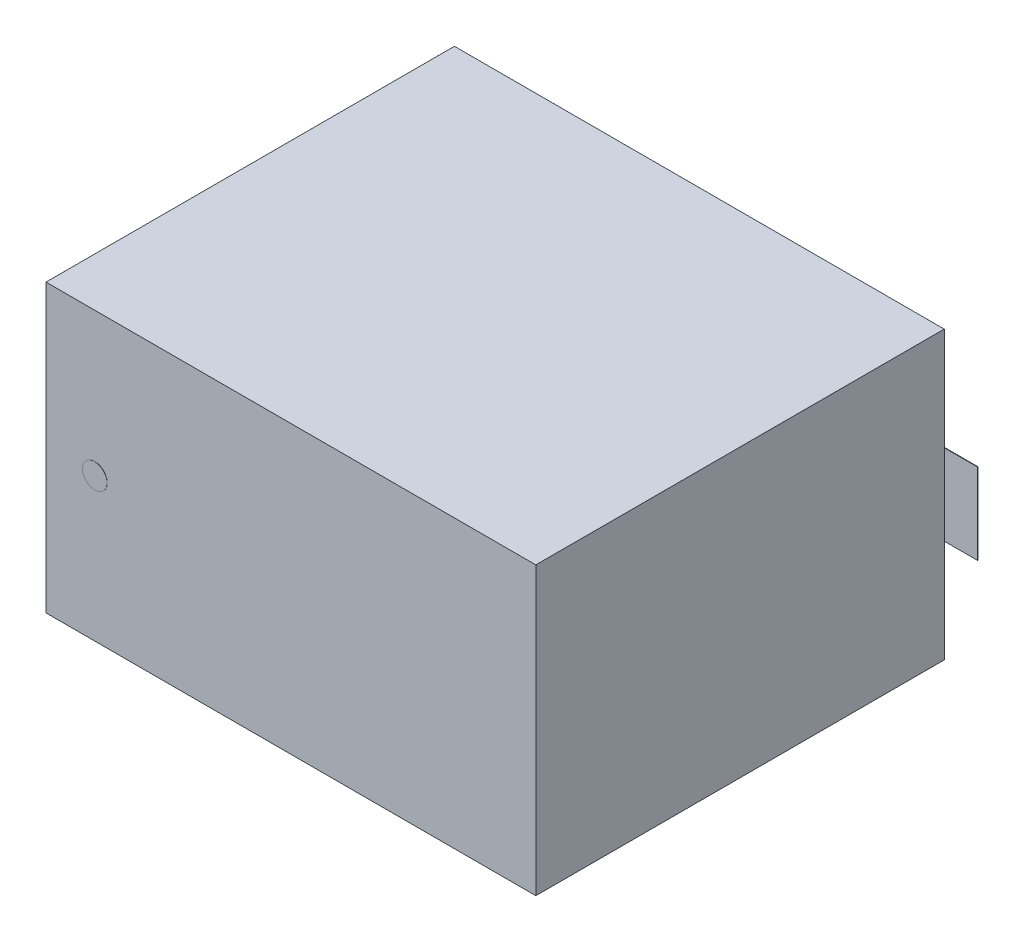
ISO-10303-21;
HEADER;
FILE_DESCRIPTION(('STEP AP214'),'2;1');
FILE_NAME('part.step','',(''),(''),'','','');
FILE_SCHEMA(('AUTOMOTIVE_DESIGN { 1 0 10303 214 1 1 1 1 }'));
ENDSEC;
DATA;
#1=APPLICATION_CONTEXT('core data for automotive mechanical design processes');
#2=APPLICATION_PROTOCOL_DEFINITION('international standard','automotive_design',2000,#1);
#3=PRODUCT_CONTEXT('',#1,'mechanical');
#4=PRODUCT('Part','Part','',(#3));
#5=PRODUCT_RELATED_PRODUCT_CATEGORY('part','',(#4));
#6=PRODUCT_DEFINITION_FORMATION('','',#4);
#7=PRODUCT_DEFINITION_CONTEXT('part definition',#1,'design');
#8=PRODUCT_DEFINITION('design','',#6,#7);
#9=PRODUCT_DEFINITION_SHAPE('','',#8);
#10=(LENGTH_UNIT() NAMED_UNIT(*) SI_UNIT(.MILLI.,.METRE.));
#11=(NAMED_UNIT(*) PLANE_ANGLE_UNIT() SI_UNIT($,.RADIAN.));
#12=(NAMED_UNIT(*) SI_UNIT($,.STERADIAN.) SOLID_ANGLE_UNIT());
#13=UNCERTAINTY_MEASURE_WITH_UNIT(LENGTH_MEASURE(1.E-05),#10,'distance_accuracy_value','');
#14=(GEOMETRIC_REPRESENTATION_CONTEXT(3) GLOBAL_UNCERTAINTY_ASSIGNED_CONTEXT((#13)) GLOBAL_UNIT_ASSIGNED_CONTEXT((#10,
#11,#12)) REPRESENTATION_CONTEXT('',''));
#15=CARTESIAN_POINT('',(0.,0.,0.));
#16=DIRECTION('',(0.,0.,1.));
#17=DIRECTION('',(1.,0.,0.));
#18=AXIS2_PLACEMENT_3D('',#15,#16,#17);
#19=CARTESIAN_POINT('',(-2.398,0.,5.004));
#20=DIRECTION('',(0.,0.,1.));
#21=DIRECTION('',(1.,0.,0.));
#22=AXIS2_PLACEMENT_3D('',#19,#20,#21);
#23=CYLINDRICAL_SURFACE('',#22,0.14986);
#24=CARTESIAN_POINT('',(-2.398,0.,5.006));
#25=DIRECTION('',(0.,0.,1.));
#26=DIRECTION('',(1.,0.,0.));
#27=AXIS2_PLACEMENT_3D('',#24,#25,#26);
#28=CIRCLE('',#27,0.14986);
#29=CARTESIAN_POINT('',(-2.548,0.,5.006));
#30=VERTEX_POINT('',#29);
#31=EDGE_CURVE('P0_E11',#30,#30,#28,.T.);
#32=ORIENTED_EDGE('',*,*,#31,.F.);
#33=CARTESIAN_POINT('',(-2.54786,0.,5.004));
#34=CARTESIAN_POINT('',(-2.54786,0.,5.006));
#35=B_SPLINE_CURVE_WITH_KNOTS('',1,(#33,#34),.UNSPECIFIED.,.F.,.F.,(2,2),(0.,
0.0020000000000007),.UNSPECIFIED.);
#36=CARTESIAN_POINT('',(-2.548,0.,5.004));
#37=VERTEX_POINT('',#36);
#38=EDGE_CURVE('P0_E24',#37,#30,#35,.T.);
#39=ORIENTED_EDGE('',*,*,#38,.F.);
#40=CARTESIAN_POINT('',(-2.398,0.,5.004));
#41=DIRECTION('',(0.,0.,-1.));
#42=DIRECTION('',(1.,0.,0.));
#43=AXIS2_PLACEMENT_3D('',#40,#41,#42);
#44=CIRCLE('',#43,0.14986);
#45=EDGE_CURVE('P0_E33',#37,#37,#44,.T.);
#46=ORIENTED_EDGE('',*,*,#45,.F.);
#47=ORIENTED_EDGE('',*,*,#38,.T.);
#48=EDGE_LOOP('',(#32,#39,#46,#47));
#49=FACE_BOUND('',#48,.T.);
#50=ADVANCED_FACE('P0_F17',(#49),#23,.T.);
#51=CARTESIAN_POINT('',(-2.398,0.,5.004));
#52=DIRECTION('',(0.,0.,1.));
#53=DIRECTION('',(0.,1.,0.));
#54=AXIS2_PLACEMENT_3D('',#51,#52,#53);
#55=PLANE('',#54);
#56=ORIENTED_EDGE('',*,*,#45,.T.);
#57=EDGE_LOOP('',(#56));
#58=FACE_BOUND('',#57,.T.);
#59=ADVANCED_FACE('P0_F36',(#58),#55,.F.);
#60=CARTESIAN_POINT('',(-2.398,0.,5.006));
#61=DIRECTION('',(0.,0.,1.));
#62=DIRECTION('',(0.,1.,0.));
#63=AXIS2_PLACEMENT_3D('',#60,#61,#62);
#64=PLANE('',#63);
#65=ORIENTED_EDGE('',*,*,#31,.T.);
#66=EDGE_LOOP('',(#65));
#67=FACE_BOUND('',#66,.T.);
#68=ADVANCED_FACE('P0_F49',(#67),#64,.T.);
#69=CLOSED_SHELL('',(#50,#59,#68));
#70=MANIFOLD_SOLID_BREP('P0_B1',#69);
#71=CARTESIAN_POINT('',(-2.997,-1.753,0.006));
#72=DIRECTION('',(0.,-1.,0.));
#73=DIRECTION('',(0.,0.,1.));
#74=AXIS2_PLACEMENT_3D('',#71,#72,#73);
#75=PLANE('',#74);
#76=DIRECTION('',(-1.,0.,0.));
#77=VECTOR('',#76,1.);
#78=CARTESIAN_POINT('',(2.997,-1.753,0.006));
#79=LINE('',#78,#77);
#80=CARTESIAN_POINT('',(2.997,-1.753,0.006));
#81=VERTEX_POINT('',#80);
#82=CARTESIAN_POINT('',(-2.997,-1.753,0.006));
#83=VERTEX_POINT('',#82);
#84=EDGE_CURVE('P1_E11',#81,#83,#79,.T.);
#85=ORIENTED_EDGE('',*,*,#84,.F.);
#86=DIRECTION('',(0.,0.,-1.));
#87=VECTOR('',#86,1.);
#88=CARTESIAN_POINT('',(2.997,-1.753,5.004));
#89=LINE('',#88,#87);
#90=CARTESIAN_POINT('',(2.997,-1.753,5.004));
#91=VERTEX_POINT('',#90);
#92=EDGE_CURVE('P1_E24',#91,#81,#89,.T.);
#93=ORIENTED_EDGE('',*,*,#92,.F.);
#94=DIRECTION('',(1.,0.,0.));
#95=VECTOR('',#94,1.);
#96=CARTESIAN_POINT('',(-2.997,-1.753,5.004));
#97=LINE('',#96,#95);
#98=CARTESIAN_POINT('',(-2.997,-1.753,5.004));
#99=VERTEX_POINT('',#98);
#100=EDGE_CURVE('P1_E88',#99,#91,#97,.T.);
#101=ORIENTED_EDGE('',*,*,#100,.F.);
#102=DIRECTION('',(0.,0.,1.));
#103=VECTOR('',#102,1.);
#104=CARTESIAN_POINT('',(-2.997,-1.753,0.006));
#105=LINE('',#104,#103);
#106=EDGE_CURVE('P1_E77',#83,#99,#105,.T.);
#107=ORIENTED_EDGE('',*,*,#106,.F.);
#108=EDGE_LOOP('',(#85,#93,#101,#107));
#109=FACE_BOUND('',#108,.T.);
#110=ADVANCED_FACE('P1_F17',(#109),#75,.T.);
#111=CARTESIAN_POINT('',(2.997,-1.753,0.006));
#112=DIRECTION('',(1.,0.,0.));
#113=DIRECTION('',(0.,0.,1.));
#114=AXIS2_PLACEMENT_3D('',#111,#112,#113);
#115=PLANE('',#114);
#116=DIRECTION('',(0.,-1.,0.));
#117=VECTOR('',#116,1.);
#118=CARTESIAN_POINT('',(2.997,1.753,0.006));
#119=LINE('',#118,#117);
#120=CARTESIAN_POINT('',(2.997,1.753,0.006));
#121=VERTEX_POINT('',#120);
#122=EDGE_CURVE('P1_E85',#121,#81,#119,.T.);
#123=ORIENTED_EDGE('',*,*,#122,.F.);
#124=DIRECTION('',(0.,0.,-1.));
#125=VECTOR('',#124,1.);
#126=CARTESIAN_POINT('',(2.997,1.753,5.004));
#127=LINE('',#126,#125);
#128=CARTESIAN_POINT('',(2.997,1.753,5.004));
#129=VERTEX_POINT('',#128);
#130=EDGE_CURVE('P1_E83',#129,#121,#127,.T.);
#131=ORIENTED_EDGE('',*,*,#130,.F.);
#132=DIRECTION('',(0.,1.,0.));
#133=VECTOR('',#132,1.);
#134=CARTESIAN_POINT('',(2.997,-1.753,5.004));
#135=LINE('',#134,#133);
#136=EDGE_CURVE('P1_E72',#91,#129,#135,.T.);
#137=ORIENTED_EDGE('',*,*,#136,.F.);
#138=ORIENTED_EDGE('',*,*,#92,.T.);
#139=EDGE_LOOP('',(#123,#131,#137,#138));
#140=FACE_BOUND('',#139,.T.);
#141=ADVANCED_FACE('P1_F90',(#140),#115,.T.);
#142=CARTESIAN_POINT('',(2.997,1.753,0.006));
#143=DIRECTION('',(0.,1.,0.));
#144=DIRECTION('',(0.,0.,1.));
#145=AXIS2_PLACEMENT_3D('',#142,#143,#144);
#146=PLANE('',#145);
#147=DIRECTION('',(1.,0.,0.));
#148=VECTOR('',#147,1.);
#149=CARTESIAN_POINT('',(-2.997,1.753,0.006));
#150=LINE('',#149,#148);
#151=CARTESIAN_POINT('',(-2.997,1.753,0.006));
#152=VERTEX_POINT('',#151);
#153=EDGE_CURVE('P1_E60',#152,#121,#150,.T.);
#154=ORIENTED_EDGE('',*,*,#153,.F.);
#155=DIRECTION('',(0.,0.,-1.));
#156=VECTOR('',#155,1.);
#157=CARTESIAN_POINT('',(-2.997,1.753,5.004));
#158=LINE('',#157,#156);
#159=CARTESIAN_POINT('',(-2.997,1.753,5.004));
#160=VERTEX_POINT('',#159);
#161=EDGE_CURVE('P1_E54',#160,#152,#158,.T.);
#162=ORIENTED_EDGE('',*,*,#161,.F.);
#163=DIRECTION('',(-1.,0.,0.));
#164=VECTOR('',#163,1.);
#165=CARTESIAN_POINT('',(2.997,1.753,5.004));
#166=LINE('',#165,#164);
#167=EDGE_CURVE('P1_E58',#129,#160,#166,.T.);
#168=ORIENTED_EDGE('',*,*,#167,.F.);
#169=ORIENTED_EDGE('',*,*,#130,.T.);
#170=EDGE_LOOP('',(#154,#162,#168,#169));
#171=FACE_BOUND('',#170,.T.);
#172=ADVANCED_FACE('P1_F56',(#171),#146,.T.);
#173=CARTESIAN_POINT('',(-2.997,1.753,0.006));
#174=DIRECTION('',(-1.,0.,0.));
#175=DIRECTION('',(0.,0.,1.));
#176=AXIS2_PLACEMENT_3D('',#173,#174,#175);
#177=PLANE('',#176);
#178=DIRECTION('',(0.,1.,0.));
#179=VECTOR('',#178,1.);
#180=CARTESIAN_POINT('',(-2.997,-1.753,0.006));
#181=LINE('',#180,#179);
#182=EDGE_CURVE('P1_E73',#83,#152,#181,.T.);
#183=ORIENTED_EDGE('',*,*,#182,.F.);
#184=ORIENTED_EDGE('',*,*,#106,.T.);
#185=DIRECTION('',(0.,-1.,0.));
#186=VECTOR('',#185,1.);
#187=CARTESIAN_POINT('',(-2.997,1.753,5.004));
#188=LINE('',#187,#186);
#189=EDGE_CURVE('P1_E70',#160,#99,#188,.T.);
#190=ORIENTED_EDGE('',*,*,#189,.F.);
#191=ORIENTED_EDGE('',*,*,#161,.T.);
#192=EDGE_LOOP('',(#183,#184,#190,#191));
#193=FACE_BOUND('',#192,.T.);
#194=ADVANCED_FACE('P1_F76',(#193),#177,.T.);
#195=CARTESIAN_POINT('',(-2.997,1.753,0.006));
#196=DIRECTION('',(0.,0.,-1.));
#197=DIRECTION('',(0.,1.,0.));
#198=AXIS2_PLACEMENT_3D('',#195,#196,#197);
#199=PLANE('',#198);
#200=ORIENTED_EDGE('',*,*,#153,.T.);
#201=ORIENTED_EDGE('',*,*,#122,.T.);
#202=ORIENTED_EDGE('',*,*,#84,.T.);
#203=ORIENTED_EDGE('',*,*,#182,.T.);
#204=EDGE_LOOP('',(#200,#201,#202,#203));
#205=FACE_BOUND('',#204,.T.);
#206=ADVANCED_FACE('P1_F91',(#205),#199,.T.);
#207=CARTESIAN_POINT('',(-2.997,-1.753,5.004));
#208=DIRECTION('',(0.,0.,1.));
#209=DIRECTION('',(0.,1.,0.));
#210=AXIS2_PLACEMENT_3D('',#207,#208,#209);
#211=PLANE('',#210);
#212=ORIENTED_EDGE('',*,*,#100,.T.);
#213=ORIENTED_EDGE('',*,*,#136,.T.);
#214=ORIENTED_EDGE('',*,*,#167,.T.);
#215=ORIENTED_EDGE('',*,*,#189,.T.);
#216=EDGE_LOOP('',(#212,#213,#214,#215));
#217=FACE_BOUND('',#216,.T.);
#218=ADVANCED_FACE('P1_F69',(#217),#211,.T.);
#219=CLOSED_SHELL('',(#110,#141,#172,#194,#206,#218));
#220=MANIFOLD_SOLID_BREP('P1_B1',#219);
#221=CARTESIAN_POINT('',(1.295,-0.495,0.));
#222=DIRECTION('',(0.,-1.,0.));
#223=DIRECTION('',(0.,0.,1.));
#224=AXIS2_PLACEMENT_3D('',#221,#222,#223);
#225=PLANE('',#224);
#226=DIRECTION('',(-1.,0.,0.));
#227=VECTOR('',#226,1.);
#228=CARTESIAN_POINT('',(3.404,-0.495000000000001,0.));
#229=LINE('',#228,#227);
#230=CARTESIAN_POINT('',(3.404,-0.495000000000001,0.));
#231=VERTEX_POINT('',#230);
#232=CARTESIAN_POINT('',(1.295,-0.495,0.));
#233=VERTEX_POINT('',#232);
#234=EDGE_CURVE('P2_E11',#231,#233,#229,.T.);
#235=ORIENTED_EDGE('',*,*,#234,.F.);
#236=DIRECTION('',(0.,0.,-1.));
#237=VECTOR('',#236,1.);
#238=CARTESIAN_POINT('',(3.404,-0.495000000000001,0.006));
#239=LINE('',#238,#237);
#240=CARTESIAN_POINT('',(3.404,-0.495000000000001,0.006));
#241=VERTEX_POINT('',#240);
#242=EDGE_CURVE('P2_E24',#241,#231,#239,.T.);
#243=ORIENTED_EDGE('',*,*,#242,.F.);
#244=DIRECTION('',(1.,0.,0.));
#245=VECTOR('',#244,1.);
#246=CARTESIAN_POINT('',(1.295,-0.495,0.006));
#247=LINE('',#246,#245);
#248=CARTESIAN_POINT('',(1.295,-0.495,0.006));
#249=VERTEX_POINT('',#248);
#250=EDGE_CURVE('P2_E88',#249,#241,#247,.T.);
#251=ORIENTED_EDGE('',*,*,#250,.F.);
#252=DIRECTION('',(0.,0.,1.));
#253=VECTOR('',#252,1.);
#254=CARTESIAN_POINT('',(1.295,-0.495,0.));
#255=LINE('',#254,#253);
#256=EDGE_CURVE('P2_E77',#233,#249,#255,.T.);
#257=ORIENTED_EDGE('',*,*,#256,.F.);
#258=EDGE_LOOP('',(#235,#243,#251,#257));
#259=FACE_BOUND('',#258,.T.);
#260=ADVANCED_FACE('P2_F17',(#259),#225,.T.);
#261=CARTESIAN_POINT('',(3.404,-0.495000000000001,0.));
#262=DIRECTION('',(1.,0.,0.));
#263=DIRECTION('',(0.,0.,1.));
#264=AXIS2_PLACEMENT_3D('',#261,#262,#263);
#265=PLANE('',#264);
#266=DIRECTION('',(0.,-1.,0.));
#267=VECTOR('',#266,1.);
#268=CARTESIAN_POINT('',(3.404,0.494999999999999,0.));
#269=LINE('',#268,#267);
#270=CARTESIAN_POINT('',(3.404,0.494999999999999,0.));
#271=VERTEX_POINT('',#270);
#272=EDGE_CURVE('P2_E85',#271,#231,#269,.T.);
#273=ORIENTED_EDGE('',*,*,#272,.F.);
#274=DIRECTION('',(0.,0.,-1.));
#275=VECTOR('',#274,1.);
#276=CARTESIAN_POINT('',(3.404,0.494999999999999,0.006));
#277=LINE('',#276,#275);
#278=CARTESIAN_POINT('',(3.404,0.494999999999999,0.006));
#279=VERTEX_POINT('',#278);
#280=EDGE_CURVE('P2_E83',#279,#271,#277,.T.);
#281=ORIENTED_EDGE('',*,*,#280,.F.);
#282=DIRECTION('',(0.,1.,0.));
#283=VECTOR('',#282,1.);
#284=CARTESIAN_POINT('',(3.404,-0.495000000000001,0.006));
#285=LINE('',#284,#283);
#286=EDGE_CURVE('P2_E72',#241,#279,#285,.T.);
#287=ORIENTED_EDGE('',*,*,#286,.F.);
#288=ORIENTED_EDGE('',*,*,#242,.T.);
#289=EDGE_LOOP('',(#273,#281,#287,#288));
#290=FACE_BOUND('',#289,.T.);
#291=ADVANCED_FACE('P2_F90',(#290),#265,.T.);
#292=CARTESIAN_POINT('',(3.404,0.494999999999999,0.));
#293=DIRECTION('',(0.,1.,0.));
#294=DIRECTION('',(0.,0.,1.));
#295=AXIS2_PLACEMENT_3D('',#292,#293,#294);
#296=PLANE('',#295);
#297=DIRECTION('',(1.,0.,0.));
#298=VECTOR('',#297,1.);
#299=CARTESIAN_POINT('',(1.295,0.495,0.));
#300=LINE('',#299,#298);
#301=CARTESIAN_POINT('',(1.295,0.495,0.));
#302=VERTEX_POINT('',#301);
#303=EDGE_CURVE('P2_E60',#302,#271,#300,.T.);
#304=ORIENTED_EDGE('',*,*,#303,.F.);
#305=DIRECTION('',(0.,0.,-1.));
#306=VECTOR('',#305,1.);
#307=CARTESIAN_POINT('',(1.295,0.495,0.006));
#308=LINE('',#307,#306);
#309=CARTESIAN_POINT('',(1.295,0.495,0.006));
#310=VERTEX_POINT('',#309);
#311=EDGE_CURVE('P2_E54',#310,#302,#308,.T.);
#312=ORIENTED_EDGE('',*,*,#311,.F.);
#313=DIRECTION('',(-1.,0.,0.));
#314=VECTOR('',#313,1.);
#315=CARTESIAN_POINT('',(3.404,0.494999999999999,0.006));
#316=LINE('',#315,#314);
#317=EDGE_CURVE('P2_E58',#279,#310,#316,.T.);
#318=ORIENTED_EDGE('',*,*,#317,.F.);
#319=ORIENTED_EDGE('',*,*,#280,.T.);
#320=EDGE_LOOP('',(#304,#312,#318,#319));
#321=FACE_BOUND('',#320,.T.);
#322=ADVANCED_FACE('P2_F56',(#321),#296,.T.);
#323=CARTESIAN_POINT('',(1.295,0.495,0.));
#324=DIRECTION('',(-1.,0.,0.));
#325=DIRECTION('',(0.,0.,1.));
#326=AXIS2_PLACEMENT_3D('',#323,#324,#325);
#327=PLANE('',#326);
#328=DIRECTION('',(0.,1.,0.));
#329=VECTOR('',#328,1.);
#330=CARTESIAN_POINT('',(1.295,-0.495,0.));
#331=LINE('',#330,#329);
#332=EDGE_CURVE('P2_E73',#233,#302,#331,.T.);
#333=ORIENTED_EDGE('',*,*,#332,.F.);
#334=ORIENTED_EDGE('',*,*,#256,.T.);
#335=DIRECTION('',(0.,-1.,0.));
#336=VECTOR('',#335,1.);
#337=CARTESIAN_POINT('',(1.295,0.495,0.006));
#338=LINE('',#337,#336);
#339=EDGE_CURVE('P2_E70',#310,#249,#338,.T.);
#340=ORIENTED_EDGE('',*,*,#339,.F.);
#341=ORIENTED_EDGE('',*,*,#311,.T.);
#342=EDGE_LOOP('',(#333,#334,#340,#341));
#343=FACE_BOUND('',#342,.T.);
#344=ADVANCED_FACE('P2_F76',(#343),#327,.T.);
#345=CARTESIAN_POINT('',(1.295,0.495,0.));
#346=DIRECTION('',(0.,0.,-1.));
#347=DIRECTION('',(0.,1.,0.));
#348=AXIS2_PLACEMENT_3D('',#345,#346,#347);
#349=PLANE('',#348);
#350=ORIENTED_EDGE('',*,*,#303,.T.);
#351=ORIENTED_EDGE('',*,*,#272,.T.);
#352=ORIENTED_EDGE('',*,*,#234,.T.);
#353=ORIENTED_EDGE('',*,*,#332,.T.);
#354=EDGE_LOOP('',(#350,#351,#352,#353));
#355=FACE_BOUND('',#354,.T.);
#356=ADVANCED_FACE('P2_F91',(#355),#349,.T.);
#357=CARTESIAN_POINT('',(1.295,-0.495,0.006));
#358=DIRECTION('',(0.,0.,1.));
#359=DIRECTION('',(0.,1.,0.));
#360=AXIS2_PLACEMENT_3D('',#357,#358,#359);
#361=PLANE('',#360);
#362=ORIENTED_EDGE('',*,*,#250,.T.);
#363=ORIENTED_EDGE('',*,*,#286,.T.);
#364=ORIENTED_EDGE('',*,*,#317,.T.);
#365=ORIENTED_EDGE('',*,*,#339,.T.);
#366=EDGE_LOOP('',(#362,#363,#364,#365));
#367=FACE_BOUND('',#366,.T.);
#368=ADVANCED_FACE('P2_F69',(#367),#361,.T.);
#369=CLOSED_SHELL('',(#260,#291,#322,#344,#356,#368));
#370=MANIFOLD_SOLID_BREP('P2_B1',#369);
#371=CARTESIAN_POINT('',(-3.404,-0.494999999999999,0.));
#372=DIRECTION('',(0.,-1.,0.));
#373=DIRECTION('',(0.,0.,1.));
#374=AXIS2_PLACEMENT_3D('',#371,#372,#373);
#375=PLANE('',#374);
#376=DIRECTION('',(-1.,0.,0.));
#377=VECTOR('',#376,1.);
#378=CARTESIAN_POINT('',(-1.295,-0.495,0.));
#379=LINE('',#378,#377);
#380=CARTESIAN_POINT('',(-1.295,-0.495,0.));
#381=VERTEX_POINT('',#380);
#382=CARTESIAN_POINT('',(-3.404,-0.494999999999999,0.));
#383=VERTEX_POINT('',#382);
#384=EDGE_CURVE('P3_E10',#381,#383,#379,.T.);
#385=ORIENTED_EDGE('',*,*,#384,.F.);
#386=DIRECTION('',(0.,0.,-1.));
#387=VECTOR('',#386,1.);
#388=CARTESIAN_POINT('',(-1.295,-0.495,0.006));
#389=LINE('',#388,#387);
#390=CARTESIAN_POINT('',(-1.295,-0.495,0.006));
#391=VERTEX_POINT('',#390);
#392=EDGE_CURVE('P3_E23',#391,#381,#389,.T.);
#393=ORIENTED_EDGE('',*,*,#392,.F.);
#394=DIRECTION('',(1.,0.,0.));
#395=VECTOR('',#394,1.);
#396=CARTESIAN_POINT('',(-3.404,-0.494999999999999,0.006));
#397=LINE('',#396,#395);
#398=CARTESIAN_POINT('',(-3.404,-0.494999999999999,0.006));
#399=VERTEX_POINT('',#398);
#400=EDGE_CURVE('P3_E86',#399,#391,#397,.T.);
#401=ORIENTED_EDGE('',*,*,#400,.F.);
#402=DIRECTION('',(0.,0.,1.));
#403=VECTOR('',#402,1.);
#404=CARTESIAN_POINT('',(-3.404,-0.494999999999999,0.));
#405=LINE('',#404,#403);
#406=EDGE_CURVE('P3_E75',#383,#399,#405,.T.);
#407=ORIENTED_EDGE('',*,*,#406,.F.);
#408=EDGE_LOOP('',(#385,#393,#401,#407));
#409=FACE_BOUND('',#408,.T.);
#410=ADVANCED_FACE('P3_F16',(#409),#375,.T.);
#411=CARTESIAN_POINT('',(-1.295,-0.495,0.));
#412=DIRECTION('',(1.,0.,0.));
#413=DIRECTION('',(0.,0.,1.));
#414=AXIS2_PLACEMENT_3D('',#411,#412,#413);
#415=PLANE('',#414);
#416=DIRECTION('',(0.,-1.,0.));
#417=VECTOR('',#416,1.);
#418=CARTESIAN_POINT('',(-1.295,0.495,0.));
#419=LINE('',#418,#417);
#420=CARTESIAN_POINT('',(-1.295,0.495,0.));
#421=VERTEX_POINT('',#420);
#422=EDGE_CURVE('P3_E83',#421,#381,#419,.T.);
#423=ORIENTED_EDGE('',*,*,#422,.F.);
#424=DIRECTION('',(0.,0.,-1.));
#425=VECTOR('',#424,1.);
#426=CARTESIAN_POINT('',(-1.295,0.495,0.006));
#427=LINE('',#426,#425);
#428=CARTESIAN_POINT('',(-1.295,0.495,0.006));
#429=VERTEX_POINT('',#428);
#430=EDGE_CURVE('P3_E81',#429,#421,#427,.T.);
#431=ORIENTED_EDGE('',*,*,#430,.F.);
#432=DIRECTION('',(0.,1.,0.));
#433=VECTOR('',#432,1.);
#434=CARTESIAN_POINT('',(-1.295,-0.495,0.006));
#435=LINE('',#434,#433);
#436=EDGE_CURVE('P3_E70',#391,#429,#435,.T.);
#437=ORIENTED_EDGE('',*,*,#436,.F.);
#438=ORIENTED_EDGE('',*,*,#392,.T.);
#439=EDGE_LOOP('',(#423,#431,#437,#438));
#440=FACE_BOUND('',#439,.T.);
#441=ADVANCED_FACE('P3_F89',(#440),#415,.T.);
#442=CARTESIAN_POINT('',(-1.295,0.495,0.));
#443=DIRECTION('',(0.,1.,0.));
#444=DIRECTION('',(0.,0.,1.));
#445=AXIS2_PLACEMENT_3D('',#442,#443,#444);
#446=PLANE('',#445);
#447=DIRECTION('',(1.,0.,0.));
#448=VECTOR('',#447,1.);
#449=CARTESIAN_POINT('',(-3.404,0.495000000000001,0.));
#450=LINE('',#449,#448);
#451=CARTESIAN_POINT('',(-3.404,0.495000000000001,0.));
#452=VERTEX_POINT('',#451);
#453=EDGE_CURVE('P3_E60',#452,#421,#450,.T.);
#454=ORIENTED_EDGE('',*,*,#453,.F.);
#455=DIRECTION('',(0.,0.,-1.));
#456=VECTOR('',#455,1.);
#457=CARTESIAN_POINT('',(-3.404,0.495000000000001,0.006));
#458=LINE('',#457,#456);
#459=CARTESIAN_POINT('',(-3.404,0.495000000000001,0.006));
#460=VERTEX_POINT('',#459);
#461=EDGE_CURVE('P3_E54',#460,#452,#458,.T.);
#462=ORIENTED_EDGE('',*,*,#461,.F.);
#463=DIRECTION('',(-1.,0.,0.));
#464=VECTOR('',#463,1.);
#465=CARTESIAN_POINT('',(-1.295,0.495,0.006));
#466=LINE('',#465,#464);
#467=EDGE_CURVE('P3_E58',#429,#460,#466,.T.);
#468=ORIENTED_EDGE('',*,*,#467,.F.);
#469=ORIENTED_EDGE('',*,*,#430,.T.);
#470=EDGE_LOOP('',(#454,#462,#468,#469));
#471=FACE_BOUND('',#470,.T.);
#472=ADVANCED_FACE('P3_F56',(#471),#446,.T.);
#473=CARTESIAN_POINT('',(-3.404,0.495000000000001,0.));
#474=DIRECTION('',(-1.,0.,0.));
#475=DIRECTION('',(0.,0.,1.));
#476=AXIS2_PLACEMENT_3D('',#473,#474,#475);
#477=PLANE('',#476);
#478=DIRECTION('',(0.,1.,0.));
#479=VECTOR('',#478,1.);
#480=CARTESIAN_POINT('',(-3.404,-0.494999999999999,0.));
#481=LINE('',#480,#479);
#482=EDGE_CURVE('P3_E71',#383,#452,#481,.T.);
#483=ORIENTED_EDGE('',*,*,#482,.F.);
#484=ORIENTED_EDGE('',*,*,#406,.T.);
#485=DIRECTION('',(0.,-1.,0.));
#486=VECTOR('',#485,1.);
#487=CARTESIAN_POINT('',(-3.404,0.495000000000001,0.006));
#488=LINE('',#487,#486);
#489=EDGE_CURVE('P3_E69',#460,#399,#488,.T.);
#490=ORIENTED_EDGE('',*,*,#489,.F.);
#491=ORIENTED_EDGE('',*,*,#461,.T.);
#492=EDGE_LOOP('',(#483,#484,#490,#491));
#493=FACE_BOUND('',#492,.T.);
#494=ADVANCED_FACE('P3_F74',(#493),#477,.T.);
#495=CARTESIAN_POINT('',(-3.404,0.495000000000001,0.));
#496=DIRECTION('',(0.,0.,-1.));
#497=DIRECTION('',(0.,1.,0.));
#498=AXIS2_PLACEMENT_3D('',#495,#496,#497);
#499=PLANE('',#498);
#500=ORIENTED_EDGE('',*,*,#453,.T.);
#501=ORIENTED_EDGE('',*,*,#422,.T.);
#502=ORIENTED_EDGE('',*,*,#384,.T.);
#503=ORIENTED_EDGE('',*,*,#482,.T.);
#504=EDGE_LOOP('',(#500,#501,#502,#503));
#505=FACE_BOUND('',#504,.T.);
#506=ADVANCED_FACE('P3_F90',(#505),#499,.T.);
#507=CARTESIAN_POINT('',(-3.404,-0.494999999999999,0.006));
#508=DIRECTION('',(0.,0.,1.));
#509=DIRECTION('',(0.,1.,0.));
#510=AXIS2_PLACEMENT_3D('',#507,#508,#509);
#511=PLANE('',#510);
#512=ORIENTED_EDGE('',*,*,#400,.T.);
#513=ORIENTED_EDGE('',*,*,#436,.T.);
#514=ORIENTED_EDGE('',*,*,#467,.T.);
#515=ORIENTED_EDGE('',*,*,#489,.T.);
#516=EDGE_LOOP('',(#512,#513,#514,#515));
#517=FACE_BOUND('',#516,.T.);
#518=ADVANCED_FACE('P3_F68',(#517),#511,.T.);
#519=CLOSED_SHELL('',(#410,#441,#472,#494,#506,#518));
#520=MANIFOLD_SOLID_BREP('P3_B1',#519);
#521=ADVANCED_BREP_SHAPE_REPRESENTATION('',(#18,#70,#220,#370,#520),#14);
#522=SHAPE_DEFINITION_REPRESENTATION(#9,#521);
ENDSEC;
END-ISO-10303-21;
